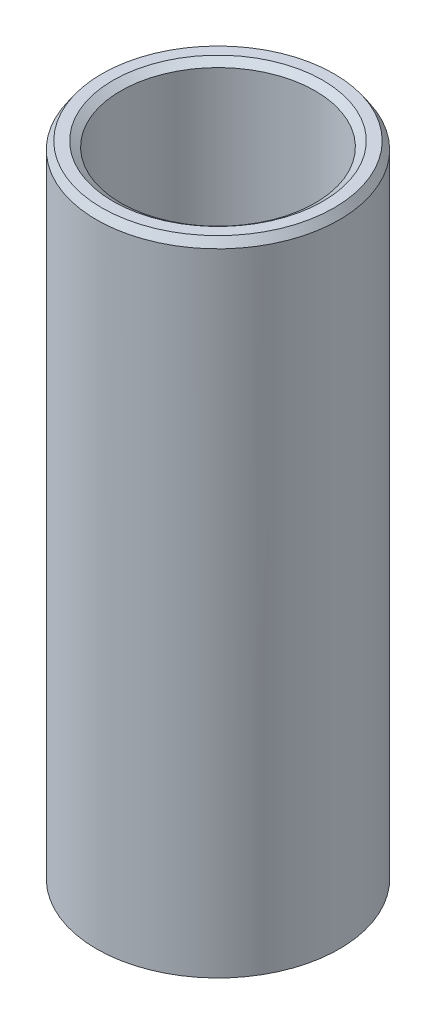
ISO-10303-21;
HEADER;
FILE_DESCRIPTION(('STEP AP214'),'2;1');
FILE_NAME('part.step','',(''),(''),'','','');
FILE_SCHEMA(('AUTOMOTIVE_DESIGN { 1 0 10303 214 1 1 1 1 }'));
ENDSEC;
DATA;
#1=APPLICATION_CONTEXT('core data for automotive mechanical design processes');
#2=APPLICATION_PROTOCOL_DEFINITION('international standard','automotive_design',2000,#1);
#3=PRODUCT_CONTEXT('',#1,'mechanical');
#4=PRODUCT('Part','Part','',(#3));
#5=PRODUCT_RELATED_PRODUCT_CATEGORY('part','',(#4));
#6=PRODUCT_DEFINITION_FORMATION('','',#4);
#7=PRODUCT_DEFINITION_CONTEXT('part definition',#1,'design');
#8=PRODUCT_DEFINITION('design','',#6,#7);
#9=PRODUCT_DEFINITION_SHAPE('','',#8);
#10=(LENGTH_UNIT() NAMED_UNIT(*) SI_UNIT(.MILLI.,.METRE.));
#11=(NAMED_UNIT(*) PLANE_ANGLE_UNIT() SI_UNIT($,.RADIAN.));
#12=(NAMED_UNIT(*) SI_UNIT($,.STERADIAN.) SOLID_ANGLE_UNIT());
#13=UNCERTAINTY_MEASURE_WITH_UNIT(LENGTH_MEASURE(1.E-05),#10,'distance_accuracy_value','');
#14=(GEOMETRIC_REPRESENTATION_CONTEXT(3) GLOBAL_UNCERTAINTY_ASSIGNED_CONTEXT((#13)) GLOBAL_UNIT_ASSIGNED_CONTEXT((#10,
#11,#12)) REPRESENTATION_CONTEXT('',''));
#15=CARTESIAN_POINT('',(0.,0.,0.));
#16=DIRECTION('',(0.,0.,1.));
#17=DIRECTION('',(1.,0.,0.));
#18=AXIS2_PLACEMENT_3D('',#15,#16,#17);
#19=CARTESIAN_POINT('',(0.,291.932881893889,0.));
#20=DIRECTION('',(0.,-1.,0.));
#21=DIRECTION('',(0.,0.,-1.));
#22=AXIS2_PLACEMENT_3D('',#19,#20,#21);
#23=CYLINDRICAL_SURFACE('',#22,55.);
#24=CARTESIAN_POINT('',(0.,2.39338890486052,0.));
#25=DIRECTION('',(0.,1.,0.));
#26=DIRECTION('',(0.,0.,1.));
#27=AXIS2_PLACEMENT_3D('',#24,#25,#26);
#28=CIRCLE('',#27,55.);
#29=CARTESIAN_POINT('',(0.,2.39338890486046,-55.));
#30=VERTEX_POINT('',#29);
#31=EDGE_CURVE('E10',#30,#30,#28,.T.);
#32=CARTESIAN_POINT('',(0.,288.439015101734,0.));
#33=DIRECTION('',(0.,1.,0.));
#34=DIRECTION('',(0.,0.,1.));
#35=AXIS2_PLACEMENT_3D('',#32,#33,#34);
#36=CIRCLE('',#35,55.);
#37=CARTESIAN_POINT('',(0.,288.439015101734,-55.));
#38=VERTEX_POINT('',#37);
#39=EDGE_CURVE('E50',#38,#38,#36,.F.);
#40=CARTESIAN_POINT('',(0.,2.39338890486046,-55.));
#41=CARTESIAN_POINT('',(0.,5.37303084441123,-55.));
#42=CARTESIAN_POINT('',(0.,8.35267278396199,-55.));
#43=CARTESIAN_POINT('',(0.,14.3119566630635,-55.));
#44=CARTESIAN_POINT('',(0.,17.2915986026143,-55.));
#45=CARTESIAN_POINT('',(0.,23.2508824817158,-55.));
#46=CARTESIAN_POINT('',(0.,26.2305244212666,-55.));
#47=CARTESIAN_POINT('',(0.,32.1898083003681,-55.));
#48=CARTESIAN_POINT('',(0.,35.1694502399189,-55.));
#49=CARTESIAN_POINT('',(0.,41.1287341190204,-55.));
#50=CARTESIAN_POINT('',(0.,44.1083760585712,-55.));
#51=CARTESIAN_POINT('',(0.,50.0676599376727,-55.));
#52=CARTESIAN_POINT('',(0.,53.0473018772235,-55.));
#53=CARTESIAN_POINT('',(0.,59.0065857563251,-55.));
#54=CARTESIAN_POINT('',(0.,61.9862276958758,-55.));
#55=CARTESIAN_POINT('',(0.,67.9455115749773,-55.));
#56=CARTESIAN_POINT('',(0.,70.9251535145281,-55.));
#57=CARTESIAN_POINT('',(0.,76.8844373936296,-55.));
#58=CARTESIAN_POINT('',(0.,79.8640793331804,-55.));
#59=CARTESIAN_POINT('',(0.,85.8233632122819,-55.));
#60=CARTESIAN_POINT('',(0.,88.8030051518327,-55.));
#61=CARTESIAN_POINT('',(0.,94.7622890309343,-55.));
#62=CARTESIAN_POINT('',(0.,97.741930970485,-55.));
#63=CARTESIAN_POINT('',(0.,103.701214849587,-55.));
#64=CARTESIAN_POINT('',(0.,106.680856789137,-55.));
#65=CARTESIAN_POINT('',(0.,112.640140668239,-55.));
#66=CARTESIAN_POINT('',(0.,115.61978260779,-55.));
#67=CARTESIAN_POINT('',(0.,121.579066486891,-55.));
#68=CARTESIAN_POINT('',(0.,124.558708426442,-55.));
#69=CARTESIAN_POINT('',(0.,130.517992305544,-55.));
#70=CARTESIAN_POINT('',(0.,133.497634245094,-55.));
#71=CARTESIAN_POINT('',(0.,139.456918124196,-55.));
#72=CARTESIAN_POINT('',(0.,142.436560063747,-55.));
#73=CARTESIAN_POINT('',(0.,148.395843942848,-55.));
#74=CARTESIAN_POINT('',(0.,151.375485882399,-55.));
#75=CARTESIAN_POINT('',(0.,157.3347697615,-55.));
#76=CARTESIAN_POINT('',(0.,160.314411701051,-55.));
#77=CARTESIAN_POINT('',(0.,166.273695580153,-55.));
#78=CARTESIAN_POINT('',(0.,169.253337519703,-55.));
#79=CARTESIAN_POINT('',(0.,175.212621398805,-55.));
#80=CARTESIAN_POINT('',(0.,178.192263338356,-55.));
#81=CARTESIAN_POINT('',(0.,184.151547217457,-55.));
#82=CARTESIAN_POINT('',(0.,187.131189157008,-55.));
#83=CARTESIAN_POINT('',(0.,193.09047303611,-55.));
#84=CARTESIAN_POINT('',(0.,196.07011497566,-55.));
#85=CARTESIAN_POINT('',(0.,202.029398854762,-55.));
#86=CARTESIAN_POINT('',(0.,205.009040794313,-55.));
#87=CARTESIAN_POINT('',(0.,210.968324673414,-55.));
#88=CARTESIAN_POINT('',(0.,213.947966612965,-55.));
#89=CARTESIAN_POINT('',(0.,219.907250492067,-55.));
#90=CARTESIAN_POINT('',(0.,222.886892431617,-55.));
#91=CARTESIAN_POINT('',(0.,228.846176310719,-55.));
#92=CARTESIAN_POINT('',(0.,231.82581825027,-55.));
#93=CARTESIAN_POINT('',(0.,237.785102129371,-55.));
#94=CARTESIAN_POINT('',(0.,240.764744068922,-55.));
#95=CARTESIAN_POINT('',(0.,246.724027948023,-55.));
#96=CARTESIAN_POINT('',(0.,249.703669887574,-55.));
#97=CARTESIAN_POINT('',(0.,255.662953766676,-55.));
#98=CARTESIAN_POINT('',(0.,258.642595706227,-55.));
#99=CARTESIAN_POINT('',(0.,264.601879585328,-55.));
#100=CARTESIAN_POINT('',(0.,267.581521524879,-55.));
#101=CARTESIAN_POINT('',(0.,273.54080540398,-55.));
#102=CARTESIAN_POINT('',(0.,276.520447343531,-55.));
#103=CARTESIAN_POINT('',(0.,282.479731222633,-55.));
#104=CARTESIAN_POINT('',(0.,285.459373162183,-55.));
#105=CARTESIAN_POINT('',(0.,288.439015101734,-55.));
#106=B_SPLINE_CURVE_WITH_KNOTS('',3,(#40,#41,#42,#43,#44,#45,#46,#47,#48,#49,#50,#51,#52,#53,
#54,#55,#56,#57,#58,#59,#60,#61,#62,#63,#64,#65,#66,#67,#68,#69,#70,#71,#72,#73,#74,#75,#76,#77,
#78,#79,#80,#81,#82,#83,#84,#85,#86,#87,#88,#89,#90,#91,#92,#93,#94,#95,#96,#97,#98,#99,#100,
#101,#102,#103,#104,#105),.UNSPECIFIED.,.F.,.F.,(4,2,2,2,2,2,2,2,2,2,2,2,2,2,2,2,2,2,2,2,2,2,2,
2,2,2,2,2,2,2,2,2,4),(0.,8.9389258186523,17.8778516373046,26.8167774559569,35.7557032746092,
44.6946290932615,53.6335549119138,62.5724807305661,71.5114065492184,80.4503323678707,
89.389258186523,98.3281840051753,107.267109823828,116.20603564248,125.144961461132,
134.083887279785,143.022813098437,151.961738917089,160.900664735741,169.839590554394,
178.778516373046,187.717442191698,196.656368010351,205.595293829003,214.534219647655,
223.473145466308,232.41207128496,241.350997103612,250.289922922265,259.228848740917,
268.167774559569,277.106700378221,286.045626196874),.UNSPECIFIED.);
#107=EDGE_CURVE('BSEAM39',#30,#38,#106,.T.);
#108=ORIENTED_EDGE('',*,*,#31,.T.);
#109=ORIENTED_EDGE('',*,*,#39,.T.);
#110=ORIENTED_EDGE('',*,*,#107,.T.);
#111=ORIENTED_EDGE('',*,*,#107,.F.);
#112=EDGE_LOOP('',(#108,#110,#109,#111));
#113=FACE_BOUND('',#112,.T.);
#114=ADVANCED_FACE('F39',(#113),#23,.T.);
#115=CARTESIAN_POINT('',(0.,291.932881893889,0.));
#116=DIRECTION('',(0.,1.,0.));
#117=DIRECTION('',(0.,0.,1.));
#118=AXIS2_PLACEMENT_3D('',#115,#116,#117);
#119=PLANE('',#118);
#120=CARTESIAN_POINT('',(0.,291.932881893889,0.));
#121=DIRECTION('',(0.,1.,0.));
#122=DIRECTION('',(0.,0.,1.));
#123=AXIS2_PLACEMENT_3D('',#120,#121,#122);
#124=CIRCLE('',#123,47.5212535078751);
#125=CARTESIAN_POINT('',(0.,291.932881893889,47.5212535078751));
#126=VERTEX_POINT('',#125);
#127=EDGE_CURVE('E58',#126,#126,#124,.F.);
#128=ORIENTED_EDGE('',*,*,#127,.T.);
#129=EDGE_LOOP('',(#128));
#130=FACE_BOUND('',#129,.T.);
#131=CARTESIAN_POINT('',(0.,291.932881893889,0.));
#132=DIRECTION('',(0.,1.,0.));
#133=DIRECTION('',(0.,0.,1.));
#134=AXIS2_PLACEMENT_3D('',#131,#132,#133);
#135=CIRCLE('',#134,52.6066110951398);
#136=CARTESIAN_POINT('',(0.,291.932881893889,52.6066110951398));
#137=VERTEX_POINT('',#136);
#138=EDGE_CURVE('E61',#137,#137,#135,.T.);
#139=ORIENTED_EDGE('',*,*,#138,.T.);
#140=EDGE_LOOP('',(#139));
#141=FACE_BOUND('',#140,.T.);
#142=ADVANCED_FACE('F88',(#130,#141),#119,.T.);
#143=CARTESIAN_POINT('',(0.,0.,0.));
#144=DIRECTION('',(0.,1.,0.));
#145=DIRECTION('',(0.,0.,1.));
#146=AXIS2_PLACEMENT_3D('',#143,#144,#145);
#147=PLANE('',#146);
#148=CARTESIAN_POINT('',(0.,0.,0.));
#149=DIRECTION('',(0.,1.,0.));
#150=DIRECTION('',(0.,0.,1.));
#151=AXIS2_PLACEMENT_3D('',#148,#149,#150);
#152=CIRCLE('',#151,46.42077562058);
#153=CARTESIAN_POINT('',(0.,0.,46.42077562058));
#154=VERTEX_POINT('',#153);
#155=EDGE_CURVE('E51',#154,#154,#152,.T.);
#156=ORIENTED_EDGE('',*,*,#155,.T.);
#157=EDGE_LOOP('',(#156));
#158=FACE_BOUND('',#157,.T.);
#159=CARTESIAN_POINT('',(0.,0.,0.));
#160=DIRECTION('',(0.,1.,0.));
#161=DIRECTION('',(0.,0.,1.));
#162=AXIS2_PLACEMENT_3D('',#159,#160,#161);
#163=CIRCLE('',#162,51.5061332078445);
#164=CARTESIAN_POINT('',(0.,0.,51.5061332078445));
#165=VERTEX_POINT('',#164);
#166=EDGE_CURVE('E54',#165,#165,#163,.F.);
#167=ORIENTED_EDGE('',*,*,#166,.T.);
#168=EDGE_LOOP('',(#167));
#169=FACE_BOUND('',#168,.T.);
#170=ADVANCED_FACE('F83',(#158,#169),#147,.F.);
#171=CARTESIAN_POINT('',(0.,291.932881893889,0.));
#172=DIRECTION('',(0.,-1.,0.));
#173=DIRECTION('',(0.,0.,-1.));
#174=AXIS2_PLACEMENT_3D('',#171,#172,#173);
#175=CYLINDRICAL_SURFACE('',#174,44.0273867157196);
#176=CARTESIAN_POINT('',(0.,289.539492989029,0.));
#177=DIRECTION('',(0.,1.,0.));
#178=DIRECTION('',(0.,0.,1.));
#179=AXIS2_PLACEMENT_3D('',#176,#177,#178);
#180=CIRCLE('',#179,44.0273867157196);
#181=CARTESIAN_POINT('',(0.,289.539492989029,-44.0273867157196));
#182=VERTEX_POINT('',#181);
#183=EDGE_CURVE('E67',#182,#182,#180,.T.);
#184=CARTESIAN_POINT('',(0.,3.4938667921553,0.));
#185=DIRECTION('',(0.,1.,0.));
#186=DIRECTION('',(0.,0.,1.));
#187=AXIS2_PLACEMENT_3D('',#184,#185,#186);
#188=CIRCLE('',#187,44.0273867157196);
#189=CARTESIAN_POINT('',(0.,3.4938667921553,-44.0273867157196));
#190=VERTEX_POINT('',#189);
#191=EDGE_CURVE('E69',#190,#190,#188,.F.);
#192=CARTESIAN_POINT('',(0.,289.539492989029,-44.0273867157196));
#193=CARTESIAN_POINT('',(0.,286.559851049478,-44.0273867157196));
#194=CARTESIAN_POINT('',(0.,283.580209109927,-44.0273867157196));
#195=CARTESIAN_POINT('',(0.,277.620925230826,-44.0273867157196));
#196=CARTESIAN_POINT('',(0.,274.641283291275,-44.0273867157196));
#197=CARTESIAN_POINT('',(0.,268.681999412173,-44.0273867157196));
#198=CARTESIAN_POINT('',(0.,265.702357472623,-44.0273867157196));
#199=CARTESIAN_POINT('',(0.,259.743073593521,-44.0273867157196));
#200=CARTESIAN_POINT('',(0.,256.76343165397,-44.0273867157196));
#201=CARTESIAN_POINT('',(0.,250.804147774869,-44.0273867157196));
#202=CARTESIAN_POINT('',(0.,247.824505835318,-44.0273867157196));
#203=CARTESIAN_POINT('',(0.,241.865221956216,-44.0273867157196));
#204=CARTESIAN_POINT('',(0.,238.885580016666,-44.0273867157196));
#205=CARTESIAN_POINT('',(0.,232.926296137564,-44.0273867157196));
#206=CARTESIAN_POINT('',(0.,229.946654198013,-44.0273867157196));
#207=CARTESIAN_POINT('',(0.,223.987370318912,-44.0273867157196));
#208=CARTESIAN_POINT('',(0.,221.007728379361,-44.0273867157196));
#209=CARTESIAN_POINT('',(0.,215.04844450026,-44.0273867157196));
#210=CARTESIAN_POINT('',(0.,212.068802560709,-44.0273867157196));
#211=CARTESIAN_POINT('',(0.,206.109518681607,-44.0273867157196));
#212=CARTESIAN_POINT('',(0.,203.129876742057,-44.0273867157196));
#213=CARTESIAN_POINT('',(0.,197.170592862955,-44.0273867157196));
#214=CARTESIAN_POINT('',(0.,194.190950923404,-44.0273867157196));
#215=CARTESIAN_POINT('',(0.,188.231667044303,-44.0273867157196));
#216=CARTESIAN_POINT('',(0.,185.252025104752,-44.0273867157196));
#217=CARTESIAN_POINT('',(0.,179.29274122565,-44.0273867157196));
#218=CARTESIAN_POINT('',(0.,176.3130992861,-44.0273867157196));
#219=CARTESIAN_POINT('',(0.,170.353815406998,-44.0273867157196));
#220=CARTESIAN_POINT('',(0.,167.374173467447,-44.0273867157196));
#221=CARTESIAN_POINT('',(0.,161.414889588346,-44.0273867157196));
#222=CARTESIAN_POINT('',(0.,158.435247648795,-44.0273867157196));
#223=CARTESIAN_POINT('',(0.,152.475963769694,-44.0273867157196));
#224=CARTESIAN_POINT('',(0.,149.496321830143,-44.0273867157196));
#225=CARTESIAN_POINT('',(0.,143.537037951041,-44.0273867157196));
#226=CARTESIAN_POINT('',(0.,140.55739601149,-44.0273867157196));
#227=CARTESIAN_POINT('',(0.,134.598112132389,-44.0273867157196));
#228=CARTESIAN_POINT('',(0.,131.618470192838,-44.0273867157196));
#229=CARTESIAN_POINT('',(0.,125.659186313737,-44.0273867157196));
#230=CARTESIAN_POINT('',(0.,122.679544374186,-44.0273867157196));
#231=CARTESIAN_POINT('',(0.,116.720260495084,-44.0273867157196));
#232=CARTESIAN_POINT('',(0.,113.740618555534,-44.0273867157196));
#233=CARTESIAN_POINT('',(0.,107.781334676432,-44.0273867157196));
#234=CARTESIAN_POINT('',(0.,104.801692736881,-44.0273867157196));
#235=CARTESIAN_POINT('',(0.,98.8424088577798,-44.0273867157196));
#236=CARTESIAN_POINT('',(0.,95.862766918229,-44.0273867157196));
#237=CARTESIAN_POINT('',(0.,89.9034830391275,-44.0273867157196));
#238=CARTESIAN_POINT('',(0.,86.9238410995767,-44.0273867157196));
#239=CARTESIAN_POINT('',(0.,80.9645572204752,-44.0273867157196));
#240=CARTESIAN_POINT('',(0.,77.9849152809244,-44.0273867157196));
#241=CARTESIAN_POINT('',(0.,72.0256314018229,-44.0273867157196));
#242=CARTESIAN_POINT('',(0.,69.0459894622721,-44.0273867157196));
#243=CARTESIAN_POINT('',(0.,63.0867055831706,-44.0273867157196));
#244=CARTESIAN_POINT('',(0.,60.1070636436198,-44.0273867157196));
#245=CARTESIAN_POINT('',(0.,54.1477797645183,-44.0273867157196));
#246=CARTESIAN_POINT('',(0.,51.1681378249675,-44.0273867157196));
#247=CARTESIAN_POINT('',(0.,45.208853945866,-44.0273867157196));
#248=CARTESIAN_POINT('',(0.,42.2292120063153,-44.0273867157196));
#249=CARTESIAN_POINT('',(0.,36.2699281272137,-44.0273867157196));
#250=CARTESIAN_POINT('',(0.,33.290286187663,-44.0273867157196));
#251=CARTESIAN_POINT('',(0.,27.3310023085614,-44.0273867157196));
#252=CARTESIAN_POINT('',(0.,24.3513603690107,-44.0273867157196));
#253=CARTESIAN_POINT('',(0.,18.3920764899091,-44.0273867157196));
#254=CARTESIAN_POINT('',(0.,15.4124345503584,-44.0273867157196));
#255=CARTESIAN_POINT('',(0.,9.45315067125683,-44.0273867157196));
#256=CARTESIAN_POINT('',(0.,6.47350873170606,-44.0273867157196));
#257=CARTESIAN_POINT('',(0.,3.4938667921553,-44.0273867157196));
#258=B_SPLINE_CURVE_WITH_KNOTS('',3,(#192,#193,#194,#195,#196,#197,#198,#199,#200,#201,#202,
#203,#204,#205,#206,#207,#208,#209,#210,#211,#212,#213,#214,#215,#216,#217,#218,#219,#220,#221,
#222,#223,#224,#225,#226,#227,#228,#229,#230,#231,#232,#233,#234,#235,#236,#237,#238,#239,#240,
#241,#242,#243,#244,#245,#246,#247,#248,#249,#250,#251,#252,#253,#254,#255,#256,#257),
.UNSPECIFIED.,.F.,.F.,(4,2,2,2,2,2,2,2,2,2,2,2,2,2,2,2,2,2,2,2,2,2,2,2,2,2,2,2,2,2,2,2,4),(0.,
8.93892581865224,17.8778516373045,26.8167774559568,35.7557032746091,44.6946290932614,
53.6335549119137,62.572480730566,71.5114065492183,80.4503323678706,89.3892581865229,
98.3281840051752,107.267109823827,116.20603564248,125.144961461132,134.083887279784,
143.022813098437,151.961738917089,160.900664735741,169.839590554394,178.778516373046,
187.717442191698,196.65636801035,205.595293829003,214.534219647655,223.473145466307,
232.41207128496,241.350997103612,250.289922922264,259.228848740916,268.167774559569,
277.106700378221,286.045626196873),.UNSPECIFIED.);
#259=EDGE_CURVE('BSEAM71',#182,#190,#258,.T.);
#260=ORIENTED_EDGE('',*,*,#183,.T.);
#261=ORIENTED_EDGE('',*,*,#191,.T.);
#262=ORIENTED_EDGE('',*,*,#259,.T.);
#263=ORIENTED_EDGE('',*,*,#259,.F.);
#264=EDGE_LOOP('',(#260,#262,#261,#263));
#265=FACE_BOUND('',#264,.T.);
#266=ADVANCED_FACE('F71',(#265),#175,.F.);
#267=CARTESIAN_POINT('',(0.,289.539492989029,0.));
#268=DIRECTION('',(0.,1.,0.));
#269=DIRECTION('',(0.,0.,1.));
#270=AXIS2_PLACEMENT_3D('',#267,#268,#269);
#271=CONICAL_SURFACE('',#270,44.0273867157196,0.970191013262416);
#272=ORIENTED_EDGE('',*,*,#127,.F.);
#273=EDGE_LOOP('',(#272));
#274=FACE_BOUND('',#273,.T.);
#275=ORIENTED_EDGE('',*,*,#183,.F.);
#276=EDGE_LOOP('',(#275));
#277=FACE_BOUND('',#276,.T.);
#278=ADVANCED_FACE('F77',(#274,#277),#271,.F.);
#279=CARTESIAN_POINT('',(0.,0.,0.));
#280=DIRECTION('',(0.,-1.,0.));
#281=DIRECTION('',(0.,0.,-1.));
#282=AXIS2_PLACEMENT_3D('',#279,#280,#281);
#283=CONICAL_SURFACE('',#282,46.42077562058,0.600605313532481);
#284=ORIENTED_EDGE('',*,*,#191,.F.);
#285=EDGE_LOOP('',(#284));
#286=FACE_BOUND('',#285,.T.);
#287=ORIENTED_EDGE('',*,*,#155,.F.);
#288=EDGE_LOOP('',(#287));
#289=FACE_BOUND('',#288,.T.);
#290=ADVANCED_FACE('F73',(#286,#289),#283,.F.);
#291=CARTESIAN_POINT('',(0.,2.39338890486052,0.));
#292=DIRECTION('',(0.,1.,0.));
#293=DIRECTION('',(0.,0.,1.));
#294=AXIS2_PLACEMENT_3D('',#291,#292,#293);
#295=CONICAL_SURFACE('',#294,55.,0.970191013262418);
#296=ORIENTED_EDGE('',*,*,#166,.F.);
#297=EDGE_LOOP('',(#296));
#298=FACE_BOUND('',#297,.T.);
#299=ORIENTED_EDGE('',*,*,#31,.F.);
#300=EDGE_LOOP('',(#299));
#301=FACE_BOUND('',#300,.T.);
#302=ADVANCED_FACE('F76',(#298,#301),#295,.T.);
#303=CARTESIAN_POINT('',(0.,291.932881893889,0.));
#304=DIRECTION('',(0.,-1.,0.));
#305=DIRECTION('',(0.,0.,-1.));
#306=AXIS2_PLACEMENT_3D('',#303,#304,#305);
#307=CONICAL_SURFACE('',#306,52.6066110951398,0.600605313532486);
#308=ORIENTED_EDGE('',*,*,#39,.F.);
#309=EDGE_LOOP('',(#308));
#310=FACE_BOUND('',#309,.T.);
#311=ORIENTED_EDGE('',*,*,#138,.F.);
#312=EDGE_LOOP('',(#311));
#313=FACE_BOUND('',#312,.T.);
#314=ADVANCED_FACE('F45',(#310,#313),#307,.T.);
#315=CLOSED_SHELL('',(#114,#142,#170,#266,#278,#290,#302,#314));
#316=MANIFOLD_SOLID_BREP('B2',#315);
#317=ADVANCED_BREP_SHAPE_REPRESENTATION('',(#18,#316),#14);
#318=SHAPE_DEFINITION_REPRESENTATION(#9,#317);
ENDSEC;
END-ISO-10303-21;
